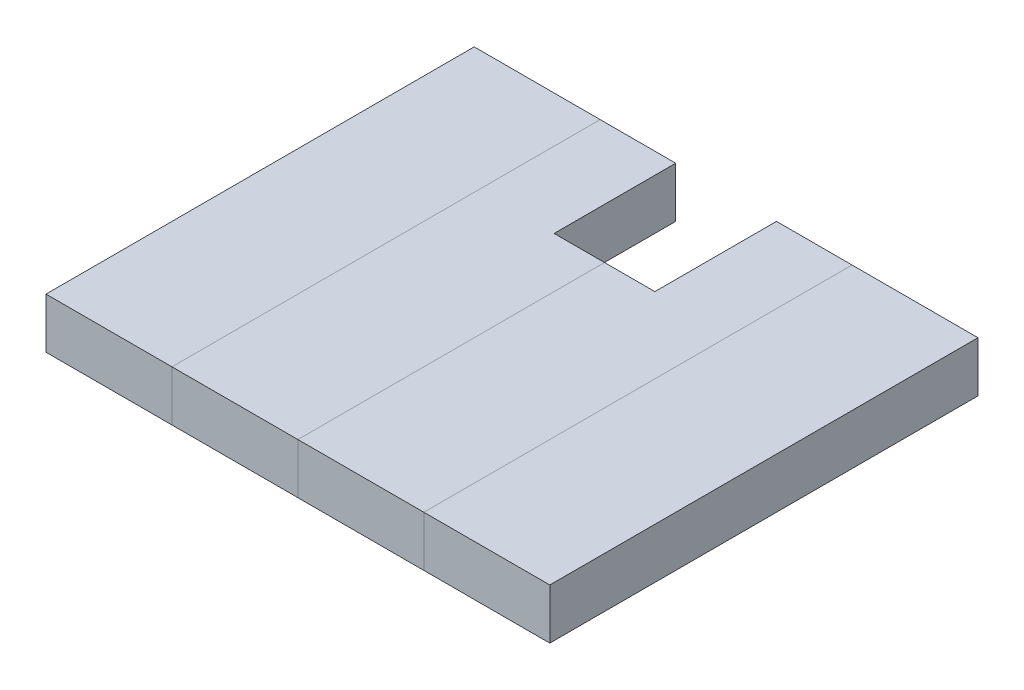
ISO-10303-21;
HEADER;
FILE_DESCRIPTION(('STEP AP214'),'2;1');
FILE_NAME('part.step','',(''),(''),'','','');
FILE_SCHEMA(('AUTOMOTIVE_DESIGN { 1 0 10303 214 1 1 1 1 }'));
ENDSEC;
DATA;
#1=APPLICATION_CONTEXT('core data for automotive mechanical design processes');
#2=APPLICATION_PROTOCOL_DEFINITION('international standard','automotive_design',2000,#1);
#3=PRODUCT_CONTEXT('',#1,'mechanical');
#4=PRODUCT('Part','Part','',(#3));
#5=PRODUCT_RELATED_PRODUCT_CATEGORY('part','',(#4));
#6=PRODUCT_DEFINITION_FORMATION('','',#4);
#7=PRODUCT_DEFINITION_CONTEXT('part definition',#1,'design');
#8=PRODUCT_DEFINITION('design','',#6,#7);
#9=PRODUCT_DEFINITION_SHAPE('','',#8);
#10=(LENGTH_UNIT() NAMED_UNIT(*) SI_UNIT(.MILLI.,.METRE.));
#11=(NAMED_UNIT(*) PLANE_ANGLE_UNIT() SI_UNIT($,.RADIAN.));
#12=(NAMED_UNIT(*) SI_UNIT($,.STERADIAN.) SOLID_ANGLE_UNIT());
#13=UNCERTAINTY_MEASURE_WITH_UNIT(LENGTH_MEASURE(1.E-05),#10,'distance_accuracy_value','');
#14=(GEOMETRIC_REPRESENTATION_CONTEXT(3) GLOBAL_UNCERTAINTY_ASSIGNED_CONTEXT((#13)) GLOBAL_UNIT_ASSIGNED_CONTEXT((#10,
#11,#12)) REPRESENTATION_CONTEXT('',''));
#15=CARTESIAN_POINT('',(0.,0.,0.));
#16=DIRECTION('',(0.,0.,1.));
#17=DIRECTION('',(1.,0.,0.));
#18=AXIS2_PLACEMENT_3D('',#15,#16,#17);
#19=CARTESIAN_POINT('',(75.,0.,0.));
#20=DIRECTION('',(0.,1.,0.));
#21=DIRECTION('',(0.,0.,1.));
#22=AXIS2_PLACEMENT_3D('',#19,#20,#21);
#23=PLANE('',#22);
#24=DIRECTION('',(0.,0.,1.));
#25=VECTOR('',#24,1.);
#26=CARTESIAN_POINT('',(62.5,0.,-42.5));
#27=LINE('',#26,#25);
#28=CARTESIAN_POINT('',(62.5,0.,-42.5));
#29=VERTEX_POINT('',#28);
#30=CARTESIAN_POINT('',(62.5,0.,42.5));
#31=VERTEX_POINT('',#30);
#32=EDGE_CURVE('P0_E79',#29,#31,#27,.T.);
#33=ORIENTED_EDGE('',*,*,#32,.F.);
#34=DIRECTION('',(-1.,0.,0.));
#35=VECTOR('',#34,1.);
#36=CARTESIAN_POINT('',(87.5,0.,-42.5));
#37=LINE('',#36,#35);
#38=CARTESIAN_POINT('',(87.5,0.,-42.5));
#39=VERTEX_POINT('',#38);
#40=EDGE_CURVE('P0_E55',#39,#29,#37,.T.);
#41=ORIENTED_EDGE('',*,*,#40,.F.);
#42=DIRECTION('',(0.,0.,-1.));
#43=VECTOR('',#42,1.);
#44=CARTESIAN_POINT('',(87.5,0.,42.5));
#45=LINE('',#44,#43);
#46=CARTESIAN_POINT('',(87.5,0.,42.5));
#47=VERTEX_POINT('',#46);
#48=EDGE_CURVE('P0_E57',#47,#39,#45,.T.);
#49=ORIENTED_EDGE('',*,*,#48,.F.);
#50=DIRECTION('',(1.,0.,0.));
#51=VECTOR('',#50,1.);
#52=CARTESIAN_POINT('',(62.5,0.,42.5));
#53=LINE('',#52,#51);
#54=EDGE_CURVE('P0_E20',#31,#47,#53,.T.);
#55=ORIENTED_EDGE('',*,*,#54,.F.);
#56=EDGE_LOOP('',(#33,#41,#49,#55));
#57=FACE_BOUND('',#56,.T.);
#58=ADVANCED_FACE('P0_F17',(#57),#23,.F.);
#59=CARTESIAN_POINT('',(62.5,0.,42.5));
#60=DIRECTION('',(0.,0.,1.));
#61=DIRECTION('',(1.,0.,0.));
#62=AXIS2_PLACEMENT_3D('',#59,#60,#61);
#63=PLANE('',#62);
#64=DIRECTION('',(1.,0.,0.));
#65=VECTOR('',#64,1.);
#66=CARTESIAN_POINT('',(75.,10.,42.5));
#67=LINE('',#66,#65);
#68=CARTESIAN_POINT('',(62.5,10.,42.5));
#69=VERTEX_POINT('',#68);
#70=CARTESIAN_POINT('',(87.5,10.,42.5));
#71=VERTEX_POINT('',#70);
#72=EDGE_CURVE('P0_E83',#69,#71,#67,.T.);
#73=ORIENTED_EDGE('',*,*,#72,.F.);
#74=DIRECTION('',(0.,1.,0.));
#75=VECTOR('',#74,1.);
#76=CARTESIAN_POINT('',(62.5,0.,42.5));
#77=LINE('',#76,#75);
#78=EDGE_CURVE('P0_E68',#31,#69,#77,.T.);
#79=ORIENTED_EDGE('',*,*,#78,.F.);
#80=ORIENTED_EDGE('',*,*,#54,.T.);
#81=DIRECTION('',(0.,1.,0.));
#82=VECTOR('',#81,1.);
#83=CARTESIAN_POINT('',(87.5,0.,42.5));
#84=LINE('',#83,#82);
#85=EDGE_CURVE('P0_E63',#71,#47,#84,.F.);
#86=ORIENTED_EDGE('',*,*,#85,.F.);
#87=EDGE_LOOP('',(#73,#79,#80,#86));
#88=FACE_BOUND('',#87,.T.);
#89=ADVANCED_FACE('P0_F65',(#88),#63,.T.);
#90=CARTESIAN_POINT('',(87.5,0.,42.5));
#91=DIRECTION('',(1.,0.,0.));
#92=DIRECTION('',(0.,0.,-1.));
#93=AXIS2_PLACEMENT_3D('',#90,#91,#92);
#94=PLANE('',#93);
#95=DIRECTION('',(0.,0.,1.));
#96=VECTOR('',#95,1.);
#97=CARTESIAN_POINT('',(87.5,10.,0.));
#98=LINE('',#97,#96);
#99=CARTESIAN_POINT('',(87.5,10.,-42.5));
#100=VERTEX_POINT('',#99);
#101=EDGE_CURVE('P0_E72',#71,#100,#98,.F.);
#102=ORIENTED_EDGE('',*,*,#101,.F.);
#103=ORIENTED_EDGE('',*,*,#85,.T.);
#104=ORIENTED_EDGE('',*,*,#48,.T.);
#105=DIRECTION('',(0.,1.,0.));
#106=VECTOR('',#105,1.);
#107=CARTESIAN_POINT('',(87.5,0.,-42.5));
#108=LINE('',#107,#106);
#109=EDGE_CURVE('P0_E75',#100,#39,#108,.F.);
#110=ORIENTED_EDGE('',*,*,#109,.F.);
#111=EDGE_LOOP('',(#102,#103,#104,#110));
#112=FACE_BOUND('',#111,.T.);
#113=ADVANCED_FACE('P0_F70',(#112),#94,.T.);
#114=CARTESIAN_POINT('',(87.5,0.,-42.5));
#115=DIRECTION('',(0.,0.,-1.));
#116=DIRECTION('',(-1.,0.,0.));
#117=AXIS2_PLACEMENT_3D('',#114,#115,#116);
#118=PLANE('',#117);
#119=DIRECTION('',(1.,0.,0.));
#120=VECTOR('',#119,1.);
#121=CARTESIAN_POINT('',(75.,10.,-42.5));
#122=LINE('',#121,#120);
#123=CARTESIAN_POINT('',(62.5,10.,-42.5));
#124=VERTEX_POINT('',#123);
#125=EDGE_CURVE('P0_E26',#100,#124,#122,.F.);
#126=ORIENTED_EDGE('',*,*,#125,.F.);
#127=ORIENTED_EDGE('',*,*,#109,.T.);
#128=ORIENTED_EDGE('',*,*,#40,.T.);
#129=DIRECTION('',(0.,1.,0.));
#130=VECTOR('',#129,1.);
#131=CARTESIAN_POINT('',(62.5,0.,-42.5));
#132=LINE('',#131,#130);
#133=EDGE_CURVE('P0_E35',#124,#29,#132,.F.);
#134=ORIENTED_EDGE('',*,*,#133,.F.);
#135=EDGE_LOOP('',(#126,#127,#128,#134));
#136=FACE_BOUND('',#135,.T.);
#137=ADVANCED_FACE('P0_F89',(#136),#118,.T.);
#138=CARTESIAN_POINT('',(62.5,0.,-42.5));
#139=DIRECTION('',(-1.,0.,0.));
#140=DIRECTION('',(0.,0.,1.));
#141=AXIS2_PLACEMENT_3D('',#138,#139,#140);
#142=PLANE('',#141);
#143=DIRECTION('',(0.,0.,1.));
#144=VECTOR('',#143,1.);
#145=CARTESIAN_POINT('',(62.5,10.,0.));
#146=LINE('',#145,#144);
#147=EDGE_CURVE('P0_E11',#124,#69,#146,.T.);
#148=ORIENTED_EDGE('',*,*,#147,.F.);
#149=ORIENTED_EDGE('',*,*,#133,.T.);
#150=ORIENTED_EDGE('',*,*,#32,.T.);
#151=ORIENTED_EDGE('',*,*,#78,.T.);
#152=EDGE_LOOP('',(#148,#149,#150,#151));
#153=FACE_BOUND('',#152,.T.);
#154=ADVANCED_FACE('P0_F91',(#153),#142,.T.);
#155=CARTESIAN_POINT('',(75.,10.,0.));
#156=DIRECTION('',(0.,1.,0.));
#157=DIRECTION('',(0.,0.,1.));
#158=AXIS2_PLACEMENT_3D('',#155,#156,#157);
#159=PLANE('',#158);
#160=ORIENTED_EDGE('',*,*,#125,.T.);
#161=ORIENTED_EDGE('',*,*,#147,.T.);
#162=ORIENTED_EDGE('',*,*,#72,.T.);
#163=ORIENTED_EDGE('',*,*,#101,.T.);
#164=EDGE_LOOP('',(#160,#161,#162,#163));
#165=FACE_BOUND('',#164,.T.);
#166=ADVANCED_FACE('P0_F88',(#165),#159,.T.);
#167=CLOSED_SHELL('',(#58,#89,#113,#137,#154,#166));
#168=MANIFOLD_SOLID_BREP('P0_B1',#167);
#169=CARTESIAN_POINT('',(50.,10.,0.));
#170=DIRECTION('',(0.,1.,0.));
#171=DIRECTION('',(0.,0.,1.));
#172=AXIS2_PLACEMENT_3D('',#169,#170,#171);
#173=PLANE('',#172);
#174=DIRECTION('',(-1.,0.,0.));
#175=VECTOR('',#174,1.);
#176=CARTESIAN_POINT('',(62.5,10.,-42.5));
#177=LINE('',#176,#175);
#178=CARTESIAN_POINT('',(47.4999999999998,10.,-42.5));
#179=VERTEX_POINT('',#178);
#180=CARTESIAN_POINT('',(62.5,10.,-42.5));
#181=VERTEX_POINT('',#180);
#182=EDGE_CURVE('P1_E93',#179,#181,#177,.F.);
#183=ORIENTED_EDGE('',*,*,#182,.F.);
#184=DIRECTION('',(0.,0.,-1.));
#185=VECTOR('',#184,1.);
#186=CARTESIAN_POINT('',(47.4999999999998,9.99999999999999,55.8883476483175));
#187=LINE('',#186,#185);
#188=CARTESIAN_POINT('',(47.4999999999998,9.99999999999998,-18.3578643762697));
#189=VERTEX_POINT('',#188);
#190=EDGE_CURVE('P1_E100',#179,#189,#187,.F.);
#191=ORIENTED_EDGE('',*,*,#190,.T.);
#192=DIRECTION('',(1.,0.,0.));
#193=VECTOR('',#192,1.);
#194=CARTESIAN_POINT('',(47.4999999999998,9.99999999999994,-18.3578643762696));
#195=LINE('',#194,#193);
#196=CARTESIAN_POINT('',(37.5,9.99999999999998,-18.3578643762697));
#197=VERTEX_POINT('',#196);
#198=EDGE_CURVE('P1_E82',#189,#197,#195,.F.);
#199=ORIENTED_EDGE('',*,*,#198,.T.);
#200=DIRECTION('',(0.,0.,1.));
#201=VECTOR('',#200,1.);
#202=CARTESIAN_POINT('',(37.5,10.,-42.5));
#203=LINE('',#202,#201);
#204=CARTESIAN_POINT('',(37.5,10.,42.5));
#205=VERTEX_POINT('',#204);
#206=EDGE_CURVE('P1_E20',#205,#197,#203,.F.);
#207=ORIENTED_EDGE('',*,*,#206,.F.);
#208=DIRECTION('',(1.,0.,0.));
#209=VECTOR('',#208,1.);
#210=CARTESIAN_POINT('',(37.5,10.,42.5));
#211=LINE('',#210,#209);
#212=CARTESIAN_POINT('',(62.5,10.,42.5));
#213=VERTEX_POINT('',#212);
#214=EDGE_CURVE('P1_E72',#213,#205,#211,.F.);
#215=ORIENTED_EDGE('',*,*,#214,.F.);
#216=DIRECTION('',(0.,0.,-1.));
#217=VECTOR('',#216,1.);
#218=CARTESIAN_POINT('',(62.5,10.,42.5));
#219=LINE('',#218,#217);
#220=EDGE_CURVE('P1_E67',#181,#213,#219,.F.);
#221=ORIENTED_EDGE('',*,*,#220,.F.);
#222=EDGE_LOOP('',(#183,#191,#199,#207,#215,#221));
#223=FACE_BOUND('',#222,.T.);
#224=ADVANCED_FACE('P1_F17',(#223),#173,.T.);
#225=CARTESIAN_POINT('',(37.5,0.,-42.5));
#226=DIRECTION('',(-1.,0.,0.));
#227=DIRECTION('',(0.,0.,1.));
#228=AXIS2_PLACEMENT_3D('',#225,#226,#227);
#229=PLANE('',#228);
#230=DIRECTION('',(0.,1.,0.));
#231=VECTOR('',#230,1.);
#232=CARTESIAN_POINT('',(37.5,0.,42.5));
#233=LINE('',#232,#231);
#234=CARTESIAN_POINT('',(37.5,0.,42.5));
#235=VERTEX_POINT('',#234);
#236=EDGE_CURVE('P1_E77',#205,#235,#233,.F.);
#237=ORIENTED_EDGE('',*,*,#236,.F.);
#238=ORIENTED_EDGE('',*,*,#206,.T.);
#239=DIRECTION('',(0.,-0.707106781186548,-0.707106781186547));
#240=VECTOR('',#239,1.);
#241=CARTESIAN_POINT('',(37.5,98.3883476483182,70.0304832720485));
#242=LINE('',#241,#240);
#243=CARTESIAN_POINT('',(37.5,0.,-28.3578643762697));
#244=VERTEX_POINT('',#243);
#245=EDGE_CURVE('P1_E102',#197,#244,#242,.T.);
#246=ORIENTED_EDGE('',*,*,#245,.T.);
#247=DIRECTION('',(0.,0.,1.));
#248=VECTOR('',#247,1.);
#249=CARTESIAN_POINT('',(37.5,0.,0.));
#250=LINE('',#249,#248);
#251=EDGE_CURVE('P1_E88',#244,#235,#250,.T.);
#252=ORIENTED_EDGE('',*,*,#251,.T.);
#253=EDGE_LOOP('',(#237,#238,#246,#252));
#254=FACE_BOUND('',#253,.T.);
#255=ADVANCED_FACE('P1_F87',(#254),#229,.T.);
#256=CARTESIAN_POINT('',(37.5,0.,42.5));
#257=DIRECTION('',(0.,0.,1.));
#258=DIRECTION('',(1.,0.,0.));
#259=AXIS2_PLACEMENT_3D('',#256,#257,#258);
#260=PLANE('',#259);
#261=ORIENTED_EDGE('',*,*,#214,.T.);
#262=ORIENTED_EDGE('',*,*,#236,.T.);
#263=DIRECTION('',(1.,0.,0.));
#264=VECTOR('',#263,1.);
#265=CARTESIAN_POINT('',(50.,0.,42.5));
#266=LINE('',#265,#264);
#267=CARTESIAN_POINT('',(62.5,0.,42.5));
#268=VERTEX_POINT('',#267);
#269=EDGE_CURVE('P1_E107',#235,#268,#266,.T.);
#270=ORIENTED_EDGE('',*,*,#269,.T.);
#271=DIRECTION('',(0.,1.,0.));
#272=VECTOR('',#271,1.);
#273=CARTESIAN_POINT('',(62.5,0.,42.5));
#274=LINE('',#273,#272);
#275=EDGE_CURVE('P1_E79',#213,#268,#274,.F.);
#276=ORIENTED_EDGE('',*,*,#275,.F.);
#277=EDGE_LOOP('',(#261,#262,#270,#276));
#278=FACE_BOUND('',#277,.T.);
#279=ADVANCED_FACE('P1_F74',(#278),#260,.T.);
#280=CARTESIAN_POINT('',(62.5,0.,42.5));
#281=DIRECTION('',(1.,0.,0.));
#282=DIRECTION('',(0.,0.,-1.));
#283=AXIS2_PLACEMENT_3D('',#280,#281,#282);
#284=PLANE('',#283);
#285=ORIENTED_EDGE('',*,*,#220,.T.);
#286=ORIENTED_EDGE('',*,*,#275,.T.);
#287=DIRECTION('',(0.,0.,1.));
#288=VECTOR('',#287,1.);
#289=CARTESIAN_POINT('',(62.5,0.,0.));
#290=LINE('',#289,#288);
#291=CARTESIAN_POINT('',(62.5,0.,-42.5));
#292=VERTEX_POINT('',#291);
#293=EDGE_CURVE('P1_E109',#268,#292,#290,.F.);
#294=ORIENTED_EDGE('',*,*,#293,.T.);
#295=DIRECTION('',(0.,1.,0.));
#296=VECTOR('',#295,1.);
#297=CARTESIAN_POINT('',(62.5,0.,-42.5));
#298=LINE('',#297,#296);
#299=EDGE_CURVE('P1_E95',#181,#292,#298,.F.);
#300=ORIENTED_EDGE('',*,*,#299,.F.);
#301=EDGE_LOOP('',(#285,#286,#294,#300));
#302=FACE_BOUND('',#301,.T.);
#303=ADVANCED_FACE('P1_F126',(#302),#284,.T.);
#304=CARTESIAN_POINT('',(62.5,0.,-42.5));
#305=DIRECTION('',(0.,0.,-1.));
#306=DIRECTION('',(-1.,0.,0.));
#307=AXIS2_PLACEMENT_3D('',#304,#305,#306);
#308=PLANE('',#307);
#309=ORIENTED_EDGE('',*,*,#299,.T.);
#310=DIRECTION('',(1.,0.,0.));
#311=VECTOR('',#310,1.);
#312=CARTESIAN_POINT('',(50.,0.,-42.5));
#313=LINE('',#312,#311);
#314=CARTESIAN_POINT('',(47.4999999999998,0.,-42.5));
#315=VERTEX_POINT('',#314);
#316=EDGE_CURVE('P1_E112',#292,#315,#313,.F.);
#317=ORIENTED_EDGE('',*,*,#316,.T.);
#318=DIRECTION('',(0.,1.,0.));
#319=VECTOR('',#318,1.);
#320=CARTESIAN_POINT('',(47.4999999999998,112.530483272049,-42.5));
#321=LINE('',#320,#319);
#322=EDGE_CURVE('P1_E97',#315,#179,#321,.T.);
#323=ORIENTED_EDGE('',*,*,#322,.T.);
#324=ORIENTED_EDGE('',*,*,#182,.T.);
#325=EDGE_LOOP('',(#309,#317,#323,#324));
#326=FACE_BOUND('',#325,.T.);
#327=ADVANCED_FACE('P1_F125',(#326),#308,.T.);
#328=CARTESIAN_POINT('',(47.4999999999998,112.530483272049,55.8883476483175));
#329=DIRECTION('',(1.,0.,0.));
#330=DIRECTION('',(0.,0.,-1.));
#331=AXIS2_PLACEMENT_3D('',#328,#329,#330);
#332=PLANE('',#331);
#333=ORIENTED_EDGE('',*,*,#322,.F.);
#334=DIRECTION('',(0.,0.,1.));
#335=VECTOR('',#334,1.);
#336=CARTESIAN_POINT('',(47.4999999999998,0.,0.));
#337=LINE('',#336,#335);
#338=CARTESIAN_POINT('',(47.4999999999998,0.,-28.3578643762697));
#339=VERTEX_POINT('',#338);
#340=EDGE_CURVE('P1_E26',#315,#339,#337,.T.);
#341=ORIENTED_EDGE('',*,*,#340,.T.);
#342=DIRECTION('',(0.,-0.707106781186548,-0.707106781186547));
#343=VECTOR('',#342,1.);
#344=CARTESIAN_POINT('',(47.4999999999998,98.3883476483182,70.0304832720485));
#345=LINE('',#344,#343);
#346=EDGE_CURVE('P1_E34',#339,#189,#345,.F.);
#347=ORIENTED_EDGE('',*,*,#346,.T.);
#348=ORIENTED_EDGE('',*,*,#190,.F.);
#349=EDGE_LOOP('',(#333,#341,#347,#348));
#350=FACE_BOUND('',#349,.T.);
#351=ADVANCED_FACE('P1_F118',(#350),#332,.F.);
#352=CARTESIAN_POINT('',(47.4999999999998,98.3883476483182,70.0304832720485));
#353=DIRECTION('',(0.,-0.707106781186547,0.707106781186548));
#354=DIRECTION('',(0.,-0.707106781186548,-0.707106781186547));
#355=AXIS2_PLACEMENT_3D('',#352,#353,#354);
#356=PLANE('',#355);
#357=ORIENTED_EDGE('',*,*,#346,.F.);
#358=DIRECTION('',(1.,0.,0.));
#359=VECTOR('',#358,1.);
#360=CARTESIAN_POINT('',(50.,0.,-28.3578643762697));
#361=LINE('',#360,#359);
#362=EDGE_CURVE('P1_E11',#339,#244,#361,.F.);
#363=ORIENTED_EDGE('',*,*,#362,.T.);
#364=ORIENTED_EDGE('',*,*,#245,.F.);
#365=ORIENTED_EDGE('',*,*,#198,.F.);
#366=EDGE_LOOP('',(#357,#363,#364,#365));
#367=FACE_BOUND('',#366,.T.);
#368=ADVANCED_FACE('P1_F127',(#367),#356,.F.);
#369=CARTESIAN_POINT('',(50.,0.,0.));
#370=DIRECTION('',(0.,1.,0.));
#371=DIRECTION('',(0.,0.,1.));
#372=AXIS2_PLACEMENT_3D('',#369,#370,#371);
#373=PLANE('',#372);
#374=ORIENTED_EDGE('',*,*,#340,.F.);
#375=ORIENTED_EDGE('',*,*,#316,.F.);
#376=ORIENTED_EDGE('',*,*,#293,.F.);
#377=ORIENTED_EDGE('',*,*,#269,.F.);
#378=ORIENTED_EDGE('',*,*,#251,.F.);
#379=ORIENTED_EDGE('',*,*,#362,.F.);
#380=EDGE_LOOP('',(#374,#375,#376,#377,#378,#379));
#381=FACE_BOUND('',#380,.T.);
#382=ADVANCED_FACE('P1_F122',(#381),#373,.F.);
#383=CLOSED_SHELL('',(#224,#255,#279,#303,#327,#351,#368,#382));
#384=MANIFOLD_SOLID_BREP('P1_B1',#383);
#385=CARTESIAN_POINT('',(0.,0.,0.));
#386=DIRECTION('',(0.,1.,0.));
#387=DIRECTION('',(0.,0.,1.));
#388=AXIS2_PLACEMENT_3D('',#385,#386,#387);
#389=PLANE('',#388);
#390=DIRECTION('',(0.,0.,1.));
#391=VECTOR('',#390,1.);
#392=CARTESIAN_POINT('',(-12.5,0.,-42.5));
#393=LINE('',#392,#391);
#394=CARTESIAN_POINT('',(-12.5,0.,-42.5));
#395=VERTEX_POINT('',#394);
#396=CARTESIAN_POINT('',(-12.5,0.,42.5));
#397=VERTEX_POINT('',#396);
#398=EDGE_CURVE('P2_E79',#395,#397,#393,.T.);
#399=ORIENTED_EDGE('',*,*,#398,.F.);
#400=DIRECTION('',(-1.,0.,0.));
#401=VECTOR('',#400,1.);
#402=CARTESIAN_POINT('',(12.5,0.,-42.5));
#403=LINE('',#402,#401);
#404=CARTESIAN_POINT('',(12.5,0.,-42.5));
#405=VERTEX_POINT('',#404);
#406=EDGE_CURVE('P2_E55',#405,#395,#403,.T.);
#407=ORIENTED_EDGE('',*,*,#406,.F.);
#408=DIRECTION('',(0.,0.,-1.));
#409=VECTOR('',#408,1.);
#410=CARTESIAN_POINT('',(12.5,0.,42.5));
#411=LINE('',#410,#409);
#412=CARTESIAN_POINT('',(12.5,0.,42.5));
#413=VERTEX_POINT('',#412);
#414=EDGE_CURVE('P2_E57',#413,#405,#411,.T.);
#415=ORIENTED_EDGE('',*,*,#414,.F.);
#416=DIRECTION('',(1.,0.,0.));
#417=VECTOR('',#416,1.);
#418=CARTESIAN_POINT('',(-12.5,0.,42.5));
#419=LINE('',#418,#417);
#420=EDGE_CURVE('P2_E20',#397,#413,#419,.T.);
#421=ORIENTED_EDGE('',*,*,#420,.F.);
#422=EDGE_LOOP('',(#399,#407,#415,#421));
#423=FACE_BOUND('',#422,.T.);
#424=ADVANCED_FACE('P2_F17',(#423),#389,.F.);
#425=CARTESIAN_POINT('',(-12.5,0.,42.5));
#426=DIRECTION('',(0.,0.,1.));
#427=DIRECTION('',(1.,0.,0.));
#428=AXIS2_PLACEMENT_3D('',#425,#426,#427);
#429=PLANE('',#428);
#430=DIRECTION('',(1.,0.,0.));
#431=VECTOR('',#430,1.);
#432=CARTESIAN_POINT('',(0.,10.,42.5));
#433=LINE('',#432,#431);
#434=CARTESIAN_POINT('',(-12.5,10.,42.5));
#435=VERTEX_POINT('',#434);
#436=CARTESIAN_POINT('',(12.5,10.,42.5));
#437=VERTEX_POINT('',#436);
#438=EDGE_CURVE('P2_E83',#435,#437,#433,.T.);
#439=ORIENTED_EDGE('',*,*,#438,.F.);
#440=DIRECTION('',(0.,1.,0.));
#441=VECTOR('',#440,1.);
#442=CARTESIAN_POINT('',(-12.5,0.,42.5));
#443=LINE('',#442,#441);
#444=EDGE_CURVE('P2_E68',#397,#435,#443,.T.);
#445=ORIENTED_EDGE('',*,*,#444,.F.);
#446=ORIENTED_EDGE('',*,*,#420,.T.);
#447=DIRECTION('',(0.,1.,0.));
#448=VECTOR('',#447,1.);
#449=CARTESIAN_POINT('',(12.5,0.,42.5));
#450=LINE('',#449,#448);
#451=EDGE_CURVE('P2_E63',#437,#413,#450,.F.);
#452=ORIENTED_EDGE('',*,*,#451,.F.);
#453=EDGE_LOOP('',(#439,#445,#446,#452));
#454=FACE_BOUND('',#453,.T.);
#455=ADVANCED_FACE('P2_F65',(#454),#429,.T.);
#456=CARTESIAN_POINT('',(12.5,0.,42.5));
#457=DIRECTION('',(1.,0.,0.));
#458=DIRECTION('',(0.,0.,-1.));
#459=AXIS2_PLACEMENT_3D('',#456,#457,#458);
#460=PLANE('',#459);
#461=DIRECTION('',(0.,0.,1.));
#462=VECTOR('',#461,1.);
#463=CARTESIAN_POINT('',(12.5,10.,0.));
#464=LINE('',#463,#462);
#465=CARTESIAN_POINT('',(12.5,10.,-42.5));
#466=VERTEX_POINT('',#465);
#467=EDGE_CURVE('P2_E72',#437,#466,#464,.F.);
#468=ORIENTED_EDGE('',*,*,#467,.F.);
#469=ORIENTED_EDGE('',*,*,#451,.T.);
#470=ORIENTED_EDGE('',*,*,#414,.T.);
#471=DIRECTION('',(0.,1.,0.));
#472=VECTOR('',#471,1.);
#473=CARTESIAN_POINT('',(12.5,0.,-42.5));
#474=LINE('',#473,#472);
#475=EDGE_CURVE('P2_E75',#466,#405,#474,.F.);
#476=ORIENTED_EDGE('',*,*,#475,.F.);
#477=EDGE_LOOP('',(#468,#469,#470,#476));
#478=FACE_BOUND('',#477,.T.);
#479=ADVANCED_FACE('P2_F70',(#478),#460,.T.);
#480=CARTESIAN_POINT('',(12.5,0.,-42.5));
#481=DIRECTION('',(0.,0.,-1.));
#482=DIRECTION('',(-1.,0.,0.));
#483=AXIS2_PLACEMENT_3D('',#480,#481,#482);
#484=PLANE('',#483);
#485=DIRECTION('',(1.,0.,0.));
#486=VECTOR('',#485,1.);
#487=CARTESIAN_POINT('',(0.,10.,-42.5));
#488=LINE('',#487,#486);
#489=CARTESIAN_POINT('',(-12.5,10.,-42.5));
#490=VERTEX_POINT('',#489);
#491=EDGE_CURVE('P2_E26',#466,#490,#488,.F.);
#492=ORIENTED_EDGE('',*,*,#491,.F.);
#493=ORIENTED_EDGE('',*,*,#475,.T.);
#494=ORIENTED_EDGE('',*,*,#406,.T.);
#495=DIRECTION('',(0.,1.,0.));
#496=VECTOR('',#495,1.);
#497=CARTESIAN_POINT('',(-12.5,0.,-42.5));
#498=LINE('',#497,#496);
#499=EDGE_CURVE('P2_E35',#490,#395,#498,.F.);
#500=ORIENTED_EDGE('',*,*,#499,.F.);
#501=EDGE_LOOP('',(#492,#493,#494,#500));
#502=FACE_BOUND('',#501,.T.);
#503=ADVANCED_FACE('P2_F89',(#502),#484,.T.);
#504=CARTESIAN_POINT('',(-12.5,0.,-42.5));
#505=DIRECTION('',(-1.,0.,0.));
#506=DIRECTION('',(0.,0.,1.));
#507=AXIS2_PLACEMENT_3D('',#504,#505,#506);
#508=PLANE('',#507);
#509=DIRECTION('',(0.,0.,1.));
#510=VECTOR('',#509,1.);
#511=CARTESIAN_POINT('',(-12.5,10.,0.));
#512=LINE('',#511,#510);
#513=EDGE_CURVE('P2_E11',#490,#435,#512,.T.);
#514=ORIENTED_EDGE('',*,*,#513,.F.);
#515=ORIENTED_EDGE('',*,*,#499,.T.);
#516=ORIENTED_EDGE('',*,*,#398,.T.);
#517=ORIENTED_EDGE('',*,*,#444,.T.);
#518=EDGE_LOOP('',(#514,#515,#516,#517));
#519=FACE_BOUND('',#518,.T.);
#520=ADVANCED_FACE('P2_F91',(#519),#508,.T.);
#521=CARTESIAN_POINT('',(0.,10.,0.));
#522=DIRECTION('',(0.,1.,0.));
#523=DIRECTION('',(0.,0.,1.));
#524=AXIS2_PLACEMENT_3D('',#521,#522,#523);
#525=PLANE('',#524);
#526=ORIENTED_EDGE('',*,*,#491,.T.);
#527=ORIENTED_EDGE('',*,*,#513,.T.);
#528=ORIENTED_EDGE('',*,*,#438,.T.);
#529=ORIENTED_EDGE('',*,*,#467,.T.);
#530=EDGE_LOOP('',(#526,#527,#528,#529));
#531=FACE_BOUND('',#530,.T.);
#532=ADVANCED_FACE('P2_F88',(#531),#525,.T.);
#533=CLOSED_SHELL('',(#424,#455,#479,#503,#520,#532));
#534=MANIFOLD_SOLID_BREP('P2_B1',#533);
#535=CARTESIAN_POINT('',(25.,10.,0.));
#536=DIRECTION('',(0.,1.,0.));
#537=DIRECTION('',(0.,0.,1.));
#538=AXIS2_PLACEMENT_3D('',#535,#536,#537);
#539=PLANE('',#538);
#540=DIRECTION('',(0.,0.,-1.));
#541=VECTOR('',#540,1.);
#542=CARTESIAN_POINT('',(37.5,10.,42.5));
#543=LINE('',#542,#541);
#544=CARTESIAN_POINT('',(37.5,9.99999999999999,-18.3578643762697));
#545=VERTEX_POINT('',#544);
#546=CARTESIAN_POINT('',(37.5,10.,42.5));
#547=VERTEX_POINT('',#546);
#548=EDGE_CURVE('P3_E93',#545,#547,#543,.F.);
#549=ORIENTED_EDGE('',*,*,#548,.F.);
#550=DIRECTION('',(1.,0.,0.));
#551=VECTOR('',#550,1.);
#552=CARTESIAN_POINT('',(47.4999999999998,9.99999999999994,-18.3578643762696));
#553=LINE('',#552,#551);
#554=CARTESIAN_POINT('',(27.4999999999998,9.99999999999997,-18.3578643762697));
#555=VERTEX_POINT('',#554);
#556=EDGE_CURVE('P3_E100',#545,#555,#553,.F.);
#557=ORIENTED_EDGE('',*,*,#556,.T.);
#558=DIRECTION('',(0.,0.,1.));
#559=VECTOR('',#558,1.);
#560=CARTESIAN_POINT('',(27.4999999999998,9.99999999999999,70.0304832720485));
#561=LINE('',#560,#559);
#562=CARTESIAN_POINT('',(27.4999999999998,10.,-42.5));
#563=VERTEX_POINT('',#562);
#564=EDGE_CURVE('P3_E82',#555,#563,#561,.F.);
#565=ORIENTED_EDGE('',*,*,#564,.T.);
#566=DIRECTION('',(-1.,0.,0.));
#567=VECTOR('',#566,1.);
#568=CARTESIAN_POINT('',(37.5,10.,-42.5));
#569=LINE('',#568,#567);
#570=CARTESIAN_POINT('',(12.5,10.,-42.5));
#571=VERTEX_POINT('',#570);
#572=EDGE_CURVE('P3_E20',#571,#563,#569,.F.);
#573=ORIENTED_EDGE('',*,*,#572,.F.);
#574=DIRECTION('',(0.,0.,1.));
#575=VECTOR('',#574,1.);
#576=CARTESIAN_POINT('',(12.5,10.,-42.5));
#577=LINE('',#576,#575);
#578=CARTESIAN_POINT('',(12.5,10.,42.5));
#579=VERTEX_POINT('',#578);
#580=EDGE_CURVE('P3_E72',#579,#571,#577,.F.);
#581=ORIENTED_EDGE('',*,*,#580,.F.);
#582=DIRECTION('',(1.,0.,0.));
#583=VECTOR('',#582,1.);
#584=CARTESIAN_POINT('',(12.5,10.,42.5));
#585=LINE('',#584,#583);
#586=EDGE_CURVE('P3_E67',#547,#579,#585,.F.);
#587=ORIENTED_EDGE('',*,*,#586,.F.);
#588=EDGE_LOOP('',(#549,#557,#565,#573,#581,#587));
#589=FACE_BOUND('',#588,.T.);
#590=ADVANCED_FACE('P3_F17',(#589),#539,.T.);
#591=CARTESIAN_POINT('',(37.5,0.,-42.5));
#592=DIRECTION('',(0.,0.,-1.));
#593=DIRECTION('',(-1.,0.,0.));
#594=AXIS2_PLACEMENT_3D('',#591,#592,#593);
#595=PLANE('',#594);
#596=DIRECTION('',(0.,1.,0.));
#597=VECTOR('',#596,1.);
#598=CARTESIAN_POINT('',(12.5,0.,-42.5));
#599=LINE('',#598,#597);
#600=CARTESIAN_POINT('',(12.5,0.,-42.5));
#601=VERTEX_POINT('',#600);
#602=EDGE_CURVE('P3_E77',#571,#601,#599,.F.);
#603=ORIENTED_EDGE('',*,*,#602,.F.);
#604=ORIENTED_EDGE('',*,*,#572,.T.);
#605=DIRECTION('',(0.,-1.,0.));
#606=VECTOR('',#605,1.);
#607=CARTESIAN_POINT('',(27.4999999999998,98.3883476483182,-42.5));
#608=LINE('',#607,#606);
#609=CARTESIAN_POINT('',(27.4999999999998,0.,-42.5));
#610=VERTEX_POINT('',#609);
#611=EDGE_CURVE('P3_E102',#563,#610,#608,.T.);
#612=ORIENTED_EDGE('',*,*,#611,.T.);
#613=DIRECTION('',(1.,0.,0.));
#614=VECTOR('',#613,1.);
#615=CARTESIAN_POINT('',(25.,0.,-42.5));
#616=LINE('',#615,#614);
#617=EDGE_CURVE('P3_E88',#610,#601,#616,.F.);
#618=ORIENTED_EDGE('',*,*,#617,.T.);
#619=EDGE_LOOP('',(#603,#604,#612,#618));
#620=FACE_BOUND('',#619,.T.);
#621=ADVANCED_FACE('P3_F87',(#620),#595,.T.);
#622=CARTESIAN_POINT('',(12.5,0.,-42.5));
#623=DIRECTION('',(-1.,0.,0.));
#624=DIRECTION('',(0.,0.,1.));
#625=AXIS2_PLACEMENT_3D('',#622,#623,#624);
#626=PLANE('',#625);
#627=ORIENTED_EDGE('',*,*,#580,.T.);
#628=ORIENTED_EDGE('',*,*,#602,.T.);
#629=DIRECTION('',(0.,0.,1.));
#630=VECTOR('',#629,1.);
#631=CARTESIAN_POINT('',(12.5,0.,0.));
#632=LINE('',#631,#630);
#633=CARTESIAN_POINT('',(12.5,0.,42.5));
#634=VERTEX_POINT('',#633);
#635=EDGE_CURVE('P3_E107',#601,#634,#632,.T.);
#636=ORIENTED_EDGE('',*,*,#635,.T.);
#637=DIRECTION('',(0.,1.,0.));
#638=VECTOR('',#637,1.);
#639=CARTESIAN_POINT('',(12.5,0.,42.5));
#640=LINE('',#639,#638);
#641=EDGE_CURVE('P3_E79',#579,#634,#640,.F.);
#642=ORIENTED_EDGE('',*,*,#641,.F.);
#643=EDGE_LOOP('',(#627,#628,#636,#642));
#644=FACE_BOUND('',#643,.T.);
#645=ADVANCED_FACE('P3_F74',(#644),#626,.T.);
#646=CARTESIAN_POINT('',(12.5,0.,42.5));
#647=DIRECTION('',(0.,0.,1.));
#648=DIRECTION('',(1.,0.,0.));
#649=AXIS2_PLACEMENT_3D('',#646,#647,#648);
#650=PLANE('',#649);
#651=ORIENTED_EDGE('',*,*,#586,.T.);
#652=ORIENTED_EDGE('',*,*,#641,.T.);
#653=DIRECTION('',(1.,0.,0.));
#654=VECTOR('',#653,1.);
#655=CARTESIAN_POINT('',(25.,0.,42.5));
#656=LINE('',#655,#654);
#657=CARTESIAN_POINT('',(37.5,0.,42.5));
#658=VERTEX_POINT('',#657);
#659=EDGE_CURVE('P3_E109',#634,#658,#656,.T.);
#660=ORIENTED_EDGE('',*,*,#659,.T.);
#661=DIRECTION('',(0.,1.,0.));
#662=VECTOR('',#661,1.);
#663=CARTESIAN_POINT('',(37.5,0.,42.5));
#664=LINE('',#663,#662);
#665=EDGE_CURVE('P3_E95',#547,#658,#664,.F.);
#666=ORIENTED_EDGE('',*,*,#665,.F.);
#667=EDGE_LOOP('',(#651,#652,#660,#666));
#668=FACE_BOUND('',#667,.T.);
#669=ADVANCED_FACE('P3_F126',(#668),#650,.T.);
#670=CARTESIAN_POINT('',(37.5,0.,42.5));
#671=DIRECTION('',(1.,0.,0.));
#672=DIRECTION('',(0.,0.,-1.));
#673=AXIS2_PLACEMENT_3D('',#670,#671,#672);
#674=PLANE('',#673);
#675=ORIENTED_EDGE('',*,*,#665,.T.);
#676=DIRECTION('',(0.,0.,1.));
#677=VECTOR('',#676,1.);
#678=CARTESIAN_POINT('',(37.5,0.,0.));
#679=LINE('',#678,#677);
#680=CARTESIAN_POINT('',(37.5,0.,-28.3578643762697));
#681=VERTEX_POINT('',#680);
#682=EDGE_CURVE('P3_E112',#658,#681,#679,.F.);
#683=ORIENTED_EDGE('',*,*,#682,.T.);
#684=DIRECTION('',(0.,-0.707106781186548,-0.707106781186547));
#685=VECTOR('',#684,1.);
#686=CARTESIAN_POINT('',(37.5,98.3883476483182,70.0304832720485));
#687=LINE('',#686,#685);
#688=EDGE_CURVE('P3_E97',#681,#545,#687,.F.);
#689=ORIENTED_EDGE('',*,*,#688,.T.);
#690=ORIENTED_EDGE('',*,*,#548,.T.);
#691=EDGE_LOOP('',(#675,#683,#689,#690));
#692=FACE_BOUND('',#691,.T.);
#693=ADVANCED_FACE('P3_F125',(#692),#674,.T.);
#694=CARTESIAN_POINT('',(47.4999999999998,98.3883476483182,70.0304832720485));
#695=DIRECTION('',(0.,-0.707106781186547,0.707106781186548));
#696=DIRECTION('',(0.,-0.707106781186548,-0.707106781186547));
#697=AXIS2_PLACEMENT_3D('',#694,#695,#696);
#698=PLANE('',#697);
#699=ORIENTED_EDGE('',*,*,#688,.F.);
#700=DIRECTION('',(1.,0.,0.));
#701=VECTOR('',#700,1.);
#702=CARTESIAN_POINT('',(25.,0.,-28.3578643762697));
#703=LINE('',#702,#701);
#704=CARTESIAN_POINT('',(27.4999999999998,0.,-28.3578643762697));
#705=VERTEX_POINT('',#704);
#706=EDGE_CURVE('P3_E26',#681,#705,#703,.F.);
#707=ORIENTED_EDGE('',*,*,#706,.T.);
#708=DIRECTION('',(0.,0.707106781186547,0.707106781186547));
#709=VECTOR('',#708,1.);
#710=CARTESIAN_POINT('',(27.4999999999998,0.,-28.3578643762697));
#711=LINE('',#710,#709);
#712=EDGE_CURVE('P3_E34',#705,#555,#711,.T.);
#713=ORIENTED_EDGE('',*,*,#712,.T.);
#714=ORIENTED_EDGE('',*,*,#556,.F.);
#715=EDGE_LOOP('',(#699,#707,#713,#714));
#716=FACE_BOUND('',#715,.T.);
#717=ADVANCED_FACE('P3_F118',(#716),#698,.F.);
#718=CARTESIAN_POINT('',(27.4999999999998,98.3883476483182,70.0304832720485));
#719=DIRECTION('',(-1.,0.,0.));
#720=DIRECTION('',(0.,-1.,0.));
#721=AXIS2_PLACEMENT_3D('',#718,#719,#720);
#722=PLANE('',#721);
#723=ORIENTED_EDGE('',*,*,#712,.F.);
#724=DIRECTION('',(0.,0.,1.));
#725=VECTOR('',#724,1.);
#726=CARTESIAN_POINT('',(27.4999999999998,0.,0.));
#727=LINE('',#726,#725);
#728=EDGE_CURVE('P3_E11',#705,#610,#727,.F.);
#729=ORIENTED_EDGE('',*,*,#728,.T.);
#730=ORIENTED_EDGE('',*,*,#611,.F.);
#731=ORIENTED_EDGE('',*,*,#564,.F.);
#732=EDGE_LOOP('',(#723,#729,#730,#731));
#733=FACE_BOUND('',#732,.T.);
#734=ADVANCED_FACE('P3_F127',(#733),#722,.F.);
#735=CARTESIAN_POINT('',(25.,0.,0.));
#736=DIRECTION('',(0.,1.,0.));
#737=DIRECTION('',(0.,0.,1.));
#738=AXIS2_PLACEMENT_3D('',#735,#736,#737);
#739=PLANE('',#738);
#740=ORIENTED_EDGE('',*,*,#706,.F.);
#741=ORIENTED_EDGE('',*,*,#682,.F.);
#742=ORIENTED_EDGE('',*,*,#659,.F.);
#743=ORIENTED_EDGE('',*,*,#635,.F.);
#744=ORIENTED_EDGE('',*,*,#617,.F.);
#745=ORIENTED_EDGE('',*,*,#728,.F.);
#746=EDGE_LOOP('',(#740,#741,#742,#743,#744,#745));
#747=FACE_BOUND('',#746,.T.);
#748=ADVANCED_FACE('P3_F122',(#747),#739,.F.);
#749=CLOSED_SHELL('',(#590,#621,#645,#669,#693,#717,#734,#748));
#750=MANIFOLD_SOLID_BREP('P3_B1',#749);
#751=ADVANCED_BREP_SHAPE_REPRESENTATION('',(#18,#168,#384,#534,#750),#14);
#752=SHAPE_DEFINITION_REPRESENTATION(#9,#751);
ENDSEC;
END-ISO-10303-21;
